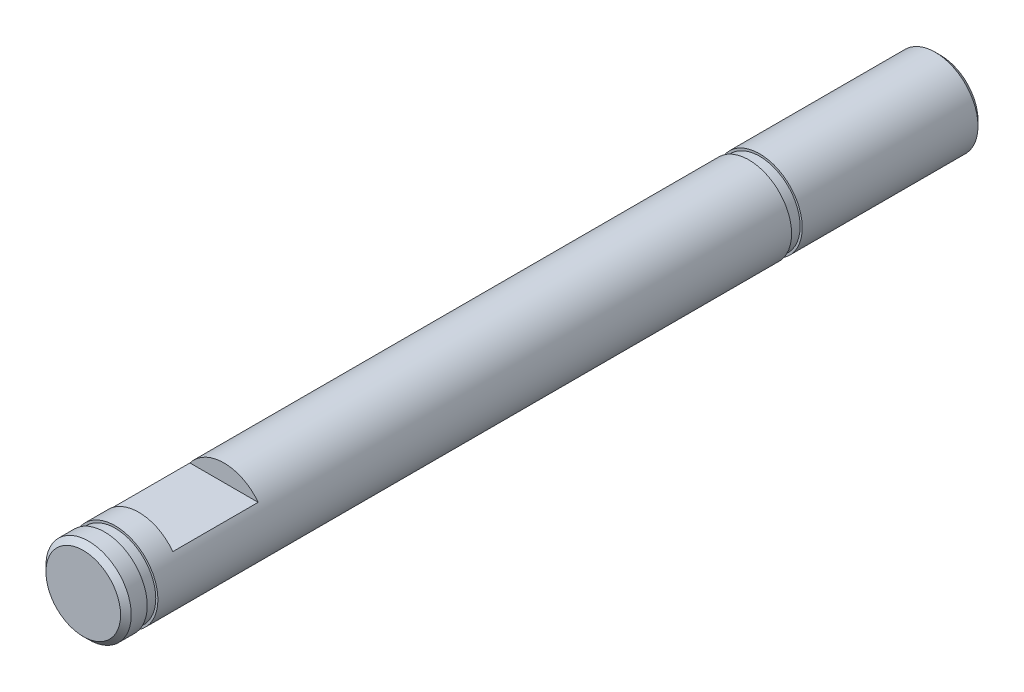
ISO-10303-21;
HEADER;
FILE_DESCRIPTION(('STEP AP214'),'2;1');
FILE_NAME('part.step','',(''),(''),'','','');
FILE_SCHEMA(('AUTOMOTIVE_DESIGN { 1 0 10303 214 1 1 1 1 }'));
ENDSEC;
DATA;
#1=APPLICATION_CONTEXT('core data for automotive mechanical design processes');
#2=APPLICATION_PROTOCOL_DEFINITION('international standard','automotive_design',2000,#1);
#3=PRODUCT_CONTEXT('',#1,'mechanical');
#4=PRODUCT('Part','Part','',(#3));
#5=PRODUCT_RELATED_PRODUCT_CATEGORY('part','',(#4));
#6=PRODUCT_DEFINITION_FORMATION('','',#4);
#7=PRODUCT_DEFINITION_CONTEXT('part definition',#1,'design');
#8=PRODUCT_DEFINITION('design','',#6,#7);
#9=PRODUCT_DEFINITION_SHAPE('','',#8);
#10=(LENGTH_UNIT() NAMED_UNIT(*) SI_UNIT(.MILLI.,.METRE.));
#11=(NAMED_UNIT(*) PLANE_ANGLE_UNIT() SI_UNIT($,.RADIAN.));
#12=(NAMED_UNIT(*) SI_UNIT($,.STERADIAN.) SOLID_ANGLE_UNIT());
#13=UNCERTAINTY_MEASURE_WITH_UNIT(LENGTH_MEASURE(1.E-05),#10,'distance_accuracy_value','');
#14=(GEOMETRIC_REPRESENTATION_CONTEXT(3) GLOBAL_UNCERTAINTY_ASSIGNED_CONTEXT((#13)) GLOBAL_UNIT_ASSIGNED_CONTEXT((#10,
#11,#12)) REPRESENTATION_CONTEXT('',''));
#15=CARTESIAN_POINT('',(0.,0.,0.));
#16=DIRECTION('',(0.,0.,1.));
#17=DIRECTION('',(1.,0.,0.));
#18=AXIS2_PLACEMENT_3D('',#15,#16,#17);
#19=CARTESIAN_POINT('',(0.,0.,40.2));
#20=DIRECTION('',(0.,0.,-1.));
#21=DIRECTION('',(-1.,0.,0.));
#22=AXIS2_PLACEMENT_3D('',#19,#20,#21);
#23=CYLINDRICAL_SURFACE('',#22,2.);
#24=CARTESIAN_POINT('',(0.,0.,39.95));
#25=DIRECTION('',(0.,0.,1.));
#26=DIRECTION('',(1.,0.,0.));
#27=AXIS2_PLACEMENT_3D('',#24,#25,#26);
#28=CIRCLE('',#27,2.);
#29=CARTESIAN_POINT('',(2.,0.,39.95));
#30=VERTEX_POINT('',#29);
#31=EDGE_CURVE('E129',#30,#30,#28,.F.);
#32=ORIENTED_EDGE('',*,*,#31,.T.);
#33=EDGE_LOOP('',(#32));
#34=FACE_BOUND('',#33,.T.);
#35=CARTESIAN_POINT('',(0.,0.,39.2));
#36=DIRECTION('',(0.,0.,1.));
#37=DIRECTION('',(1.,0.,0.));
#38=AXIS2_PLACEMENT_3D('',#35,#36,#37);
#39=CIRCLE('',#38,2.);
#40=CARTESIAN_POINT('',(2.,0.,39.2));
#41=VERTEX_POINT('',#40);
#42=EDGE_CURVE('E115',#41,#41,#39,.T.);
#43=ORIENTED_EDGE('',*,*,#42,.T.);
#44=EDGE_LOOP('',(#43));
#45=FACE_BOUND('',#44,.T.);
#46=ADVANCED_FACE('F35',(#34,#45),#23,.T.);
#47=CARTESIAN_POINT('',(0.,0.,40.2));
#48=DIRECTION('',(0.,0.,1.));
#49=DIRECTION('',(1.,0.,0.));
#50=AXIS2_PLACEMENT_3D('',#47,#48,#49);
#51=PLANE('',#50);
#52=CARTESIAN_POINT('',(0.,0.,40.2));
#53=DIRECTION('',(0.,0.,1.));
#54=DIRECTION('',(1.,0.,0.));
#55=AXIS2_PLACEMENT_3D('',#52,#53,#54);
#56=CIRCLE('',#55,1.75);
#57=CARTESIAN_POINT('',(1.75,0.,40.2));
#58=VERTEX_POINT('',#57);
#59=EDGE_CURVE('E110',#58,#58,#56,.T.);
#60=ORIENTED_EDGE('',*,*,#59,.T.);
#61=EDGE_LOOP('',(#60));
#62=FACE_BOUND('',#61,.T.);
#63=ADVANCED_FACE('F146',(#62),#51,.T.);
#64=CARTESIAN_POINT('',(0.,0.,39.2));
#65=DIRECTION('',(0.,0.,1.));
#66=DIRECTION('',(1.,0.,0.));
#67=AXIS2_PLACEMENT_3D('',#64,#65,#66);
#68=PLANE('',#67);
#69=CARTESIAN_POINT('',(0.,0.,39.2));
#70=DIRECTION('',(0.,0.,1.));
#71=DIRECTION('',(1.,0.,0.));
#72=AXIS2_PLACEMENT_3D('',#69,#70,#71);
#73=CIRCLE('',#72,1.9);
#74=CARTESIAN_POINT('',(1.9,0.,39.2));
#75=VERTEX_POINT('',#74);
#76=EDGE_CURVE('E116',#75,#75,#73,.T.);
#77=ORIENTED_EDGE('',*,*,#76,.T.);
#78=EDGE_LOOP('',(#77));
#79=FACE_BOUND('',#78,.T.);
#80=ORIENTED_EDGE('',*,*,#42,.F.);
#81=EDGE_LOOP('',(#80));
#82=FACE_BOUND('',#81,.T.);
#83=ADVANCED_FACE('F153',(#79,#82),#68,.F.);
#84=CARTESIAN_POINT('',(0.,0.,38.7));
#85=DIRECTION('',(0.,0.,1.));
#86=DIRECTION('',(1.,0.,0.));
#87=AXIS2_PLACEMENT_3D('',#84,#85,#86);
#88=PLANE('',#87);
#89=CARTESIAN_POINT('',(0.,0.,38.7));
#90=DIRECTION('',(0.,0.,1.));
#91=DIRECTION('',(1.,0.,0.));
#92=AXIS2_PLACEMENT_3D('',#89,#90,#91);
#93=CIRCLE('',#92,1.9);
#94=CARTESIAN_POINT('',(1.9,0.,38.7));
#95=VERTEX_POINT('',#94);
#96=EDGE_CURVE('E126',#95,#95,#93,.T.);
#97=ORIENTED_EDGE('',*,*,#96,.F.);
#98=EDGE_LOOP('',(#97));
#99=FACE_BOUND('',#98,.T.);
#100=CARTESIAN_POINT('',(0.,0.,38.7));
#101=DIRECTION('',(0.,0.,1.));
#102=DIRECTION('',(1.,0.,0.));
#103=AXIS2_PLACEMENT_3D('',#100,#101,#102);
#104=CIRCLE('',#103,2.);
#105=CARTESIAN_POINT('',(2.,0.,38.7));
#106=VERTEX_POINT('',#105);
#107=EDGE_CURVE('E112',#106,#106,#104,.T.);
#108=ORIENTED_EDGE('',*,*,#107,.T.);
#109=EDGE_LOOP('',(#108));
#110=FACE_BOUND('',#109,.T.);
#111=ADVANCED_FACE('F188',(#99,#110),#88,.T.);
#112=CARTESIAN_POINT('',(0.,0.,39.2));
#113=DIRECTION('',(0.,0.,-1.));
#114=DIRECTION('',(-1.,0.,0.));
#115=AXIS2_PLACEMENT_3D('',#112,#113,#114);
#116=CYLINDRICAL_SURFACE('',#115,1.9);
#117=ORIENTED_EDGE('',*,*,#76,.F.);
#118=EDGE_LOOP('',(#117));
#119=FACE_BOUND('',#118,.T.);
#120=ORIENTED_EDGE('',*,*,#96,.T.);
#121=EDGE_LOOP('',(#120));
#122=FACE_BOUND('',#121,.T.);
#123=ADVANCED_FACE('F184',(#119,#122),#116,.T.);
#124=CARTESIAN_POINT('',(0.,0.,37.6));
#125=DIRECTION('',(0.,0.,1.));
#126=DIRECTION('',(1.,0.,0.));
#127=AXIS2_PLACEMENT_3D('',#124,#125,#126);
#128=PLANE('',#127);
#129=CARTESIAN_POINT('',(0.,0.,37.6));
#130=DIRECTION('',(0.,0.,1.));
#131=DIRECTION('',(1.,0.,0.));
#132=AXIS2_PLACEMENT_3D('',#129,#130,#131);
#133=CIRCLE('',#132,2.);
#134=CARTESIAN_POINT('',(1.6,1.2,37.6));
#135=VERTEX_POINT('',#134);
#136=CARTESIAN_POINT('',(-1.6,1.2,37.6));
#137=VERTEX_POINT('',#136);
#138=EDGE_CURVE('E94',#135,#137,#133,.T.);
#139=ORIENTED_EDGE('',*,*,#138,.F.);
#140=DIRECTION('',(1.,0.,0.));
#141=VECTOR('',#140,1.);
#142=CARTESIAN_POINT('',(-1.6,1.2,37.6));
#143=LINE('',#142,#141);
#144=EDGE_CURVE('E56',#137,#135,#143,.T.);
#145=ORIENTED_EDGE('',*,*,#144,.F.);
#146=EDGE_LOOP('',(#139,#145));
#147=FACE_BOUND('',#146,.T.);
#148=ADVANCED_FACE('F187',(#147),#128,.F.);
#149=CARTESIAN_POINT('',(-1.6,1.2,33.6));
#150=DIRECTION('',(0.,-1.,0.));
#151=DIRECTION('',(0.,0.,-1.));
#152=AXIS2_PLACEMENT_3D('',#149,#150,#151);
#153=PLANE('',#152);
#154=ORIENTED_EDGE('',*,*,#144,.T.);
#155=DIRECTION('',(0.,0.,1.));
#156=VECTOR('',#155,1.);
#157=CARTESIAN_POINT('',(1.6,1.2,33.6));
#158=LINE('',#157,#156);
#159=CARTESIAN_POINT('',(1.6,1.2,33.6));
#160=VERTEX_POINT('',#159);
#161=EDGE_CURVE('E107',#160,#135,#158,.T.);
#162=ORIENTED_EDGE('',*,*,#161,.F.);
#163=DIRECTION('',(1.,0.,0.));
#164=VECTOR('',#163,1.);
#165=CARTESIAN_POINT('',(-1.6,1.2,33.6));
#166=LINE('',#165,#164);
#167=CARTESIAN_POINT('',(-1.6,1.2,33.6));
#168=VERTEX_POINT('',#167);
#169=EDGE_CURVE('E100',#168,#160,#166,.T.);
#170=ORIENTED_EDGE('',*,*,#169,.F.);
#171=DIRECTION('',(0.,0.,1.));
#172=VECTOR('',#171,1.);
#173=CARTESIAN_POINT('',(-1.6,1.2,33.6));
#174=LINE('',#173,#172);
#175=EDGE_CURVE('E103',#168,#137,#174,.T.);
#176=ORIENTED_EDGE('',*,*,#175,.T.);
#177=EDGE_LOOP('',(#154,#162,#170,#176));
#178=FACE_BOUND('',#177,.T.);
#179=ADVANCED_FACE('F204',(#178),#153,.F.);
#180=CARTESIAN_POINT('',(0.,0.,33.6));
#181=DIRECTION('',(0.,0.,1.));
#182=DIRECTION('',(1.,0.,0.));
#183=AXIS2_PLACEMENT_3D('',#180,#181,#182);
#184=PLANE('',#183);
#185=CARTESIAN_POINT('',(0.,0.,33.6));
#186=DIRECTION('',(0.,0.,1.));
#187=DIRECTION('',(1.,0.,0.));
#188=AXIS2_PLACEMENT_3D('',#185,#186,#187);
#189=CIRCLE('',#188,2.);
#190=EDGE_CURVE('E98',#160,#168,#189,.T.);
#191=ORIENTED_EDGE('',*,*,#190,.T.);
#192=ORIENTED_EDGE('',*,*,#169,.T.);
#193=EDGE_LOOP('',(#191,#192));
#194=FACE_BOUND('',#193,.T.);
#195=ADVANCED_FACE('F199',(#194),#184,.T.);
#196=CARTESIAN_POINT('',(0.,0.,17.09));
#197=DIRECTION('',(0.,0.,1.));
#198=DIRECTION('',(1.,0.,0.));
#199=AXIS2_PLACEMENT_3D('',#196,#197,#198);
#200=PLANE('',#199);
#201=CARTESIAN_POINT('',(0.,0.,17.09));
#202=DIRECTION('',(0.,0.,1.));
#203=DIRECTION('',(1.,0.,0.));
#204=AXIS2_PLACEMENT_3D('',#201,#202,#203);
#205=CIRCLE('',#204,2.);
#206=CARTESIAN_POINT('',(-1.95956984675487,0.400107505164687,17.09));
#207=VERTEX_POINT('',#206);
#208=CARTESIAN_POINT('',(0.164576352133264,-1.99321715433078,17.09));
#209=VERTEX_POINT('',#208);
#210=EDGE_CURVE('E92',#207,#209,#205,.T.);
#211=ORIENTED_EDGE('',*,*,#210,.F.);
#212=DIRECTION('',(-0.66379568715254,0.747913956092335,0.));
#213=VECTOR('',#212,1.);
#214=CARTESIAN_POINT('',(0.164576352133264,-1.99321715433079,17.09));
#215=LINE('',#214,#213);
#216=EDGE_CURVE('E49',#209,#207,#215,.T.);
#217=ORIENTED_EDGE('',*,*,#216,.F.);
#218=EDGE_LOOP('',(#211,#217));
#219=FACE_BOUND('',#218,.T.);
#220=ADVANCED_FACE('F196',(#219),#200,.F.);
#221=CARTESIAN_POINT('',(0.164576352133264,-1.99321715433079,12.09));
#222=DIRECTION('',(0.747913956092335,0.66379568715254,0.));
#223=DIRECTION('',(-0.66379568715254,0.747913956092335,0.));
#224=AXIS2_PLACEMENT_3D('',#221,#222,#223);
#225=PLANE('',#224);
#226=ORIENTED_EDGE('',*,*,#216,.T.);
#227=DIRECTION('',(0.,0.,1.));
#228=VECTOR('',#227,1.);
#229=CARTESIAN_POINT('',(-1.95956984675487,0.400107505164687,12.09));
#230=LINE('',#229,#228);
#231=CARTESIAN_POINT('',(-1.95956984675487,0.400107505164687,12.09));
#232=VERTEX_POINT('',#231);
#233=EDGE_CURVE('E88',#232,#207,#230,.T.);
#234=ORIENTED_EDGE('',*,*,#233,.F.);
#235=DIRECTION('',(-0.66379568715254,0.747913956092335,0.));
#236=VECTOR('',#235,1.);
#237=CARTESIAN_POINT('',(0.164576352133264,-1.99321715433079,12.09));
#238=LINE('',#237,#236);
#239=CARTESIAN_POINT('',(0.164576352133264,-1.99321715433079,12.09));
#240=VERTEX_POINT('',#239);
#241=EDGE_CURVE('E79',#240,#232,#238,.T.);
#242=ORIENTED_EDGE('',*,*,#241,.F.);
#243=DIRECTION('',(0.,0.,1.));
#244=VECTOR('',#243,1.);
#245=CARTESIAN_POINT('',(0.164576352133264,-1.99321715433079,12.09));
#246=LINE('',#245,#244);
#247=EDGE_CURVE('E86',#240,#209,#246,.T.);
#248=ORIENTED_EDGE('',*,*,#247,.T.);
#249=EDGE_LOOP('',(#226,#234,#242,#248));
#250=FACE_BOUND('',#249,.T.);
#251=ADVANCED_FACE('F85',(#250),#225,.F.);
#252=CARTESIAN_POINT('',(0.,0.,12.09));
#253=DIRECTION('',(0.,0.,1.));
#254=DIRECTION('',(1.,0.,0.));
#255=AXIS2_PLACEMENT_3D('',#252,#253,#254);
#256=PLANE('',#255);
#257=CARTESIAN_POINT('',(0.,0.,12.09));
#258=DIRECTION('',(0.,0.,1.));
#259=DIRECTION('',(1.,0.,0.));
#260=AXIS2_PLACEMENT_3D('',#257,#258,#259);
#261=CIRCLE('',#260,2.);
#262=EDGE_CURVE('E76',#232,#240,#261,.T.);
#263=ORIENTED_EDGE('',*,*,#262,.T.);
#264=ORIENTED_EDGE('',*,*,#241,.T.);
#265=EDGE_LOOP('',(#263,#264));
#266=FACE_BOUND('',#265,.T.);
#267=ADVANCED_FACE('F78',(#266),#256,.T.);
#268=CARTESIAN_POINT('',(0.,0.,8.99000000000001));
#269=DIRECTION('',(0.,0.,1.));
#270=DIRECTION('',(1.,0.,0.));
#271=AXIS2_PLACEMENT_3D('',#268,#269,#270);
#272=CIRCLE('',#271,2.);
#273=CARTESIAN_POINT('',(2.,0.,8.99000000000001));
#274=VERTEX_POINT('',#273);
#275=EDGE_CURVE('E119',#274,#274,#272,.T.);
#276=ORIENTED_EDGE('',*,*,#275,.T.);
#277=EDGE_LOOP('',(#276));
#278=FACE_BOUND('',#277,.T.);
#279=ORIENTED_EDGE('',*,*,#262,.F.);
#280=ORIENTED_EDGE('',*,*,#233,.T.);
#281=ORIENTED_EDGE('',*,*,#210,.T.);
#282=ORIENTED_EDGE('',*,*,#247,.F.);
#283=EDGE_LOOP('',(#279,#280,#281,#282));
#284=FACE_BOUND('',#283,.T.);
#285=ORIENTED_EDGE('',*,*,#190,.F.);
#286=ORIENTED_EDGE('',*,*,#161,.T.);
#287=ORIENTED_EDGE('',*,*,#138,.T.);
#288=ORIENTED_EDGE('',*,*,#175,.F.);
#289=EDGE_LOOP('',(#285,#286,#287,#288));
#290=FACE_BOUND('',#289,.T.);
#291=ORIENTED_EDGE('',*,*,#107,.F.);
#292=EDGE_LOOP('',(#291));
#293=FACE_BOUND('',#292,.T.);
#294=ADVANCED_FACE('F90',(#278,#284,#290,#293),#23,.T.);
#295=CARTESIAN_POINT('',(0.,0.,8.49));
#296=DIRECTION('',(0.,0.,1.));
#297=DIRECTION('',(1.,0.,0.));
#298=AXIS2_PLACEMENT_3D('',#295,#296,#297);
#299=PLANE('',#298);
#300=CARTESIAN_POINT('',(0.,0.,8.49));
#301=DIRECTION('',(0.,0.,1.));
#302=DIRECTION('',(1.,0.,0.));
#303=AXIS2_PLACEMENT_3D('',#300,#301,#302);
#304=CIRCLE('',#303,1.9);
#305=CARTESIAN_POINT('',(1.9,0.,8.49));
#306=VERTEX_POINT('',#305);
#307=EDGE_CURVE('E123',#306,#306,#304,.T.);
#308=ORIENTED_EDGE('',*,*,#307,.F.);
#309=EDGE_LOOP('',(#308));
#310=FACE_BOUND('',#309,.T.);
#311=CARTESIAN_POINT('',(0.,0.,8.49));
#312=DIRECTION('',(0.,0.,1.));
#313=DIRECTION('',(1.,0.,0.));
#314=AXIS2_PLACEMENT_3D('',#311,#312,#313);
#315=CIRCLE('',#314,2.);
#316=CARTESIAN_POINT('',(2.,0.,8.49));
#317=VERTEX_POINT('',#316);
#318=EDGE_CURVE('E122',#317,#317,#315,.T.);
#319=ORIENTED_EDGE('',*,*,#318,.T.);
#320=EDGE_LOOP('',(#319));
#321=FACE_BOUND('',#320,.T.);
#322=ADVANCED_FACE('F161',(#310,#321),#299,.T.);
#323=CARTESIAN_POINT('',(0.,0.,8.99));
#324=DIRECTION('',(0.,0.,1.));
#325=DIRECTION('',(1.,0.,0.));
#326=AXIS2_PLACEMENT_3D('',#323,#324,#325);
#327=PLANE('',#326);
#328=CARTESIAN_POINT('',(0.,0.,8.99));
#329=DIRECTION('',(0.,0.,1.));
#330=DIRECTION('',(1.,0.,0.));
#331=AXIS2_PLACEMENT_3D('',#328,#329,#330);
#332=CIRCLE('',#331,1.9);
#333=CARTESIAN_POINT('',(1.9,0.,8.99));
#334=VERTEX_POINT('',#333);
#335=EDGE_CURVE('E329',#334,#334,#332,.T.);
#336=ORIENTED_EDGE('',*,*,#335,.T.);
#337=EDGE_LOOP('',(#336));
#338=FACE_BOUND('',#337,.T.);
#339=ORIENTED_EDGE('',*,*,#275,.F.);
#340=EDGE_LOOP('',(#339));
#341=FACE_BOUND('',#340,.T.);
#342=ADVANCED_FACE('F167',(#338,#341),#327,.F.);
#343=CARTESIAN_POINT('',(0.,0.,8.49));
#344=DIRECTION('',(0.,0.,1.));
#345=DIRECTION('',(1.,0.,0.));
#346=AXIS2_PLACEMENT_3D('',#343,#344,#345);
#347=CYLINDRICAL_SURFACE('',#346,1.9);
#348=ORIENTED_EDGE('',*,*,#307,.T.);
#349=EDGE_LOOP('',(#348));
#350=FACE_BOUND('',#349,.T.);
#351=ORIENTED_EDGE('',*,*,#335,.F.);
#352=EDGE_LOOP('',(#351));
#353=FACE_BOUND('',#352,.T.);
#354=ADVANCED_FACE('F174',(#350,#353),#347,.T.);
#355=CARTESIAN_POINT('',(0.,0.,0.));
#356=DIRECTION('',(0.,0.,1.));
#357=DIRECTION('',(1.,0.,0.));
#358=AXIS2_PLACEMENT_3D('',#355,#356,#357);
#359=PLANE('',#358);
#360=CARTESIAN_POINT('',(0.,0.,0.));
#361=DIRECTION('',(0.,0.,1.));
#362=DIRECTION('',(1.,0.,0.));
#363=AXIS2_PLACEMENT_3D('',#360,#361,#362);
#364=CIRCLE('',#363,1.75);
#365=CARTESIAN_POINT('',(1.75,0.,0.));
#366=VERTEX_POINT('',#365);
#367=EDGE_CURVE('E12',#366,#366,#364,.F.);
#368=ORIENTED_EDGE('',*,*,#367,.T.);
#369=EDGE_LOOP('',(#368));
#370=FACE_BOUND('',#369,.T.);
#371=ADVANCED_FACE('F159',(#370),#359,.F.);
#372=CARTESIAN_POINT('',(0.,0.,0.249999999999993));
#373=DIRECTION('',(0.,0.,1.));
#374=DIRECTION('',(1.,0.,0.));
#375=AXIS2_PLACEMENT_3D('',#372,#373,#374);
#376=CIRCLE('',#375,2.);
#377=CARTESIAN_POINT('',(2.,0.,0.249999999999993));
#378=VERTEX_POINT('',#377);
#379=EDGE_CURVE('E43',#378,#378,#376,.T.);
#380=ORIENTED_EDGE('',*,*,#379,.T.);
#381=EDGE_LOOP('',(#380));
#382=FACE_BOUND('',#381,.T.);
#383=ORIENTED_EDGE('',*,*,#318,.F.);
#384=EDGE_LOOP('',(#383));
#385=FACE_BOUND('',#384,.T.);
#386=ADVANCED_FACE('F134',(#382,#385),#23,.T.);
#387=CARTESIAN_POINT('',(0.,0.,40.2));
#388=DIRECTION('',(0.,0.,-1.));
#389=DIRECTION('',(-1.,0.,0.));
#390=AXIS2_PLACEMENT_3D('',#387,#388,#389);
#391=CONICAL_SURFACE('',#390,1.75,0.785398163397445);
#392=ORIENTED_EDGE('',*,*,#31,.F.);
#393=EDGE_LOOP('',(#392));
#394=FACE_BOUND('',#393,.T.);
#395=ORIENTED_EDGE('',*,*,#59,.F.);
#396=EDGE_LOOP('',(#395));
#397=FACE_BOUND('',#396,.T.);
#398=ADVANCED_FACE('F138',(#394,#397),#391,.T.);
#399=CARTESIAN_POINT('',(0.,0.,0.249999999999993));
#400=DIRECTION('',(0.,0.,1.));
#401=DIRECTION('',(1.,0.,0.));
#402=AXIS2_PLACEMENT_3D('',#399,#400,#401);
#403=CONICAL_SURFACE('',#402,2.,0.785398163397459);
#404=ORIENTED_EDGE('',*,*,#367,.F.);
#405=EDGE_LOOP('',(#404));
#406=FACE_BOUND('',#405,.T.);
#407=ORIENTED_EDGE('',*,*,#379,.F.);
#408=EDGE_LOOP('',(#407));
#409=FACE_BOUND('',#408,.T.);
#410=ADVANCED_FACE('F37',(#406,#409),#403,.T.);
#411=CLOSED_SHELL('',(#46,#63,#83,#111,#123,#148,#179,#195,#220,#251,#267,#294,#322,#342,#354,
#371,#386,#398,#410));
#412=MANIFOLD_SOLID_BREP('B2',#411);
#413=ADVANCED_BREP_SHAPE_REPRESENTATION('',(#18,#412),#14);
#414=SHAPE_DEFINITION_REPRESENTATION(#9,#413);
ENDSEC;
END-ISO-10303-21;
